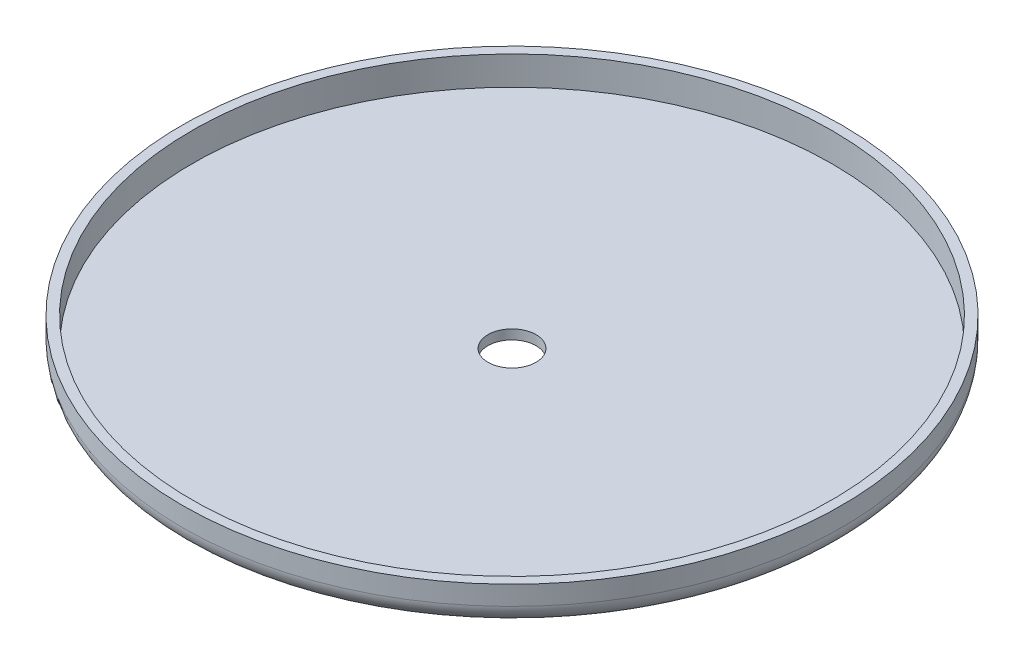
ISO-10303-21;
HEADER;
FILE_DESCRIPTION(('STEP AP214'),'2;1');
FILE_NAME('part.step','',(''),(''),'','','');
FILE_SCHEMA(('AUTOMOTIVE_DESIGN { 1 0 10303 214 1 1 1 1 }'));
ENDSEC;
DATA;
#1=APPLICATION_CONTEXT('core data for automotive mechanical design processes');
#2=APPLICATION_PROTOCOL_DEFINITION('international standard','automotive_design',2000,#1);
#3=PRODUCT_CONTEXT('',#1,'mechanical');
#4=PRODUCT('Part','Part','',(#3));
#5=PRODUCT_RELATED_PRODUCT_CATEGORY('part','',(#4));
#6=PRODUCT_DEFINITION_FORMATION('','',#4);
#7=PRODUCT_DEFINITION_CONTEXT('part definition',#1,'design');
#8=PRODUCT_DEFINITION('design','',#6,#7);
#9=PRODUCT_DEFINITION_SHAPE('','',#8);
#10=(LENGTH_UNIT() NAMED_UNIT(*) SI_UNIT(.MILLI.,.METRE.));
#11=(NAMED_UNIT(*) PLANE_ANGLE_UNIT() SI_UNIT($,.RADIAN.));
#12=(NAMED_UNIT(*) SI_UNIT($,.STERADIAN.) SOLID_ANGLE_UNIT());
#13=UNCERTAINTY_MEASURE_WITH_UNIT(LENGTH_MEASURE(1.E-05),#10,'distance_accuracy_value','');
#14=(GEOMETRIC_REPRESENTATION_CONTEXT(3) GLOBAL_UNCERTAINTY_ASSIGNED_CONTEXT((#13)) GLOBAL_UNIT_ASSIGNED_CONTEXT((#10,
#11,#12)) REPRESENTATION_CONTEXT('',''));
#15=CARTESIAN_POINT('',(0.,0.,0.));
#16=DIRECTION('',(0.,0.,1.));
#17=DIRECTION('',(1.,0.,0.));
#18=AXIS2_PLACEMENT_3D('',#15,#16,#17);
#19=CARTESIAN_POINT('',(0.,1.27,0.));
#20=DIRECTION('',(0.,1.,0.));
#21=DIRECTION('',(0.,0.,1.));
#22=AXIS2_PLACEMENT_3D('',#19,#20,#21);
#23=PLANE('',#22);
#24=CARTESIAN_POINT('',(0.,1.27,0.));
#25=DIRECTION('',(0.,1.,0.));
#26=DIRECTION('',(0.,0.,1.));
#27=AXIS2_PLACEMENT_3D('',#24,#25,#26);
#28=CIRCLE('',#27,42.291);
#29=CARTESIAN_POINT('',(0.,1.27,42.291));
#30=VERTEX_POINT('',#29);
#31=EDGE_CURVE('E60',#30,#30,#28,.T.);
#32=ORIENTED_EDGE('',*,*,#31,.T.);
#33=EDGE_LOOP('',(#32));
#34=FACE_BOUND('',#33,.T.);
#35=CARTESIAN_POINT('',(0.,1.27,0.));
#36=DIRECTION('',(0.,1.,0.));
#37=DIRECTION('',(0.,0.,1.));
#38=AXIS2_PLACEMENT_3D('',#35,#36,#37);
#39=CIRCLE('',#38,3.175);
#40=CARTESIAN_POINT('',(0.,1.27,3.175));
#41=VERTEX_POINT('',#40);
#42=EDGE_CURVE('E50',#41,#41,#39,.T.);
#43=ORIENTED_EDGE('',*,*,#42,.F.);
#44=EDGE_LOOP('',(#43));
#45=FACE_BOUND('',#44,.T.);
#46=ADVANCED_FACE('F37',(#34,#45),#23,.T.);
#47=CARTESIAN_POINT('',(0.,0.,0.));
#48=DIRECTION('',(0.,1.,0.));
#49=DIRECTION('',(0.,0.,1.));
#50=AXIS2_PLACEMENT_3D('',#47,#48,#49);
#51=PLANE('',#50);
#52=CARTESIAN_POINT('',(0.,0.,0.));
#53=DIRECTION('',(0.,1.,0.));
#54=DIRECTION('',(0.,0.,1.));
#55=AXIS2_PLACEMENT_3D('',#52,#53,#54);
#56=CIRCLE('',#55,41.021);
#57=CARTESIAN_POINT('',(0.,0.,41.021));
#58=VERTEX_POINT('',#57);
#59=EDGE_CURVE('E45',#58,#58,#56,.F.);
#60=ORIENTED_EDGE('',*,*,#59,.T.);
#61=EDGE_LOOP('',(#60));
#62=FACE_BOUND('',#61,.T.);
#63=CARTESIAN_POINT('',(0.,0.,0.));
#64=DIRECTION('',(0.,1.,0.));
#65=DIRECTION('',(0.,0.,1.));
#66=AXIS2_PLACEMENT_3D('',#63,#64,#65);
#67=CIRCLE('',#66,3.175);
#68=CARTESIAN_POINT('',(0.,0.,3.175));
#69=VERTEX_POINT('',#68);
#70=EDGE_CURVE('E55',#69,#69,#67,.T.);
#71=ORIENTED_EDGE('',*,*,#70,.T.);
#72=EDGE_LOOP('',(#71));
#73=FACE_BOUND('',#72,.T.);
#74=ADVANCED_FACE('F90',(#62,#73),#51,.F.);
#75=CARTESIAN_POINT('',(0.,1.27,0.));
#76=DIRECTION('',(0.,-1.,0.));
#77=DIRECTION('',(0.,0.,-1.));
#78=AXIS2_PLACEMENT_3D('',#75,#76,#77);
#79=CYLINDRICAL_SURFACE('',#78,3.175);
#80=ORIENTED_EDGE('',*,*,#42,.T.);
#81=EDGE_LOOP('',(#80));
#82=FACE_BOUND('',#81,.T.);
#83=ORIENTED_EDGE('',*,*,#70,.F.);
#84=EDGE_LOOP('',(#83));
#85=FACE_BOUND('',#84,.T.);
#86=ADVANCED_FACE('F96',(#82,#85),#79,.F.);
#87=CARTESIAN_POINT('',(0.,5.08,0.));
#88=DIRECTION('',(0.,-1.,0.));
#89=DIRECTION('',(0.,0.,-1.));
#90=AXIS2_PLACEMENT_3D('',#87,#88,#89);
#91=CYLINDRICAL_SURFACE('',#90,43.561);
#92=CARTESIAN_POINT('',(0.,2.54,0.));
#93=DIRECTION('',(0.,1.,0.));
#94=DIRECTION('',(0.,0.,1.));
#95=AXIS2_PLACEMENT_3D('',#92,#93,#94);
#96=CIRCLE('',#95,43.561);
#97=CARTESIAN_POINT('',(0.,2.54,43.561));
#98=VERTEX_POINT('',#97);
#99=EDGE_CURVE('E10',#98,#98,#96,.T.);
#100=ORIENTED_EDGE('',*,*,#99,.T.);
#101=EDGE_LOOP('',(#100));
#102=FACE_BOUND('',#101,.T.);
#103=CARTESIAN_POINT('',(0.,5.08,0.));
#104=DIRECTION('',(0.,-1.,0.));
#105=DIRECTION('',(0.,0.,-1.));
#106=AXIS2_PLACEMENT_3D('',#103,#104,#105);
#107=CIRCLE('',#106,43.561);
#108=CARTESIAN_POINT('',(0.,5.08,-43.561));
#109=VERTEX_POINT('',#108);
#110=EDGE_CURVE('E65',#109,#109,#107,.T.);
#111=ORIENTED_EDGE('',*,*,#110,.T.);
#112=EDGE_LOOP('',(#111));
#113=FACE_BOUND('',#112,.T.);
#114=ADVANCED_FACE('F86',(#102,#113),#91,.T.);
#115=CARTESIAN_POINT('',(0.,5.08,0.));
#116=DIRECTION('',(0.,-1.,0.));
#117=DIRECTION('',(0.,0.,-1.));
#118=AXIS2_PLACEMENT_3D('',#115,#116,#117);
#119=PLANE('',#118);
#120=CARTESIAN_POINT('',(0.,5.08,0.));
#121=DIRECTION('',(0.,-1.,0.));
#122=DIRECTION('',(0.,0.,-1.));
#123=AXIS2_PLACEMENT_3D('',#120,#121,#122);
#124=CIRCLE('',#123,42.291);
#125=CARTESIAN_POINT('',(0.,5.08,-42.291));
#126=VERTEX_POINT('',#125);
#127=EDGE_CURVE('E69',#126,#126,#124,.T.);
#128=ORIENTED_EDGE('',*,*,#127,.T.);
#129=EDGE_LOOP('',(#128));
#130=FACE_BOUND('',#129,.T.);
#131=ORIENTED_EDGE('',*,*,#110,.F.);
#132=EDGE_LOOP('',(#131));
#133=FACE_BOUND('',#132,.T.);
#134=ADVANCED_FACE('F74',(#130,#133),#119,.F.);
#135=CARTESIAN_POINT('',(0.,5.08,0.));
#136=DIRECTION('',(0.,-1.,0.));
#137=DIRECTION('',(0.,0.,-1.));
#138=AXIS2_PLACEMENT_3D('',#135,#136,#137);
#139=CYLINDRICAL_SURFACE('',#138,42.291);
#140=ORIENTED_EDGE('',*,*,#31,.F.);
#141=EDGE_LOOP('',(#140));
#142=FACE_BOUND('',#141,.T.);
#143=ORIENTED_EDGE('',*,*,#127,.F.);
#144=EDGE_LOOP('',(#143));
#145=FACE_BOUND('',#144,.T.);
#146=ADVANCED_FACE('F77',(#142,#145),#139,.F.);
#147=CARTESIAN_POINT('',(0.,2.54,0.));
#148=DIRECTION('',(0.,1.,0.));
#149=DIRECTION('',(0.,0.,1.));
#150=AXIS2_PLACEMENT_3D('',#147,#148,#149);
#151=TOROIDAL_SURFACE('',#150,41.021,2.54);
#152=ORIENTED_EDGE('',*,*,#99,.F.);
#153=EDGE_LOOP('',(#152));
#154=FACE_BOUND('',#153,.T.);
#155=ORIENTED_EDGE('',*,*,#59,.F.);
#156=EDGE_LOOP('',(#155));
#157=FACE_BOUND('',#156,.T.);
#158=ADVANCED_FACE('F39',(#154,#157),#151,.T.);
#159=CLOSED_SHELL('',(#46,#74,#86,#114,#134,#146,#158));
#160=MANIFOLD_SOLID_BREP('B2',#159);
#161=ADVANCED_BREP_SHAPE_REPRESENTATION('',(#18,#160),#14);
#162=SHAPE_DEFINITION_REPRESENTATION(#9,#161);
ENDSEC;
END-ISO-10303-21;
